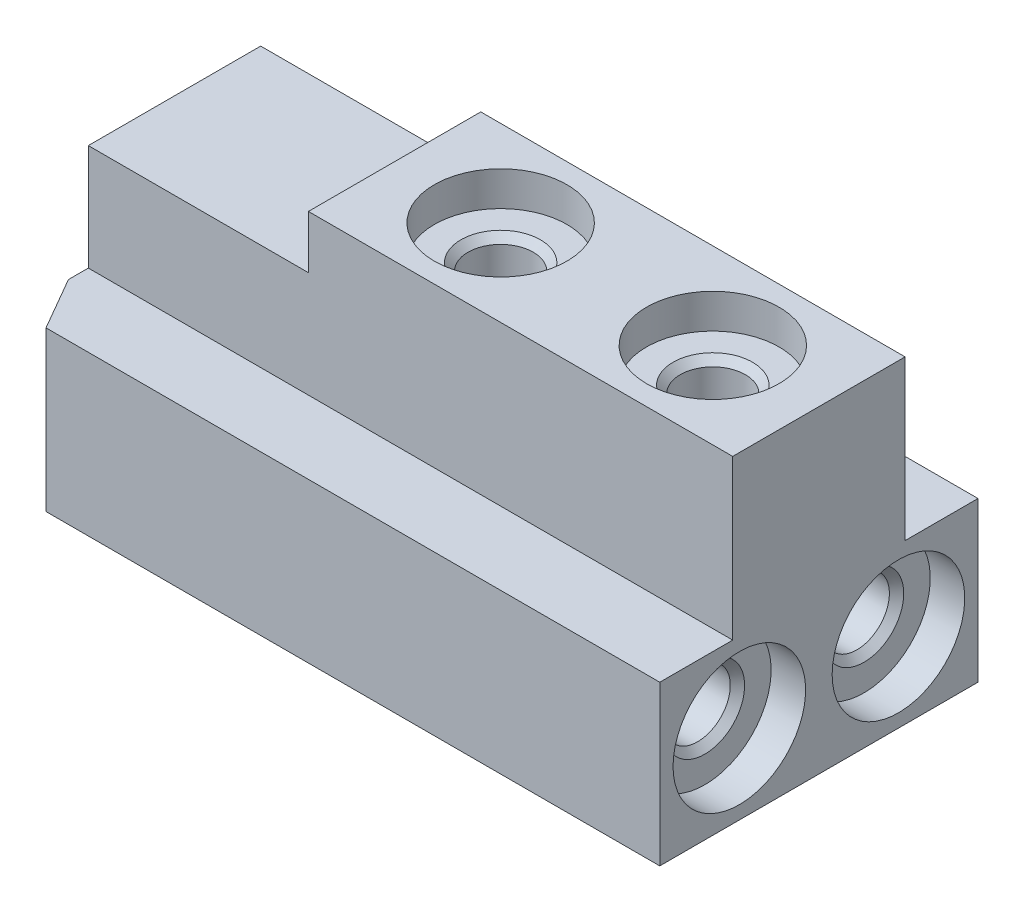
ISO-10303-21;
HEADER;
FILE_DESCRIPTION(('STEP AP214'),'2;1');
FILE_NAME('part.step','',(''),(''),'','','');
FILE_SCHEMA(('AUTOMOTIVE_DESIGN { 1 0 10303 214 1 1 1 1 }'));
ENDSEC;
DATA;
#1=APPLICATION_CONTEXT('core data for automotive mechanical design processes');
#2=APPLICATION_PROTOCOL_DEFINITION('international standard','automotive_design',2000,#1);
#3=PRODUCT_CONTEXT('',#1,'mechanical');
#4=PRODUCT('Part','Part','',(#3));
#5=PRODUCT_RELATED_PRODUCT_CATEGORY('part','',(#4));
#6=PRODUCT_DEFINITION_FORMATION('','',#4);
#7=PRODUCT_DEFINITION_CONTEXT('part definition',#1,'design');
#8=PRODUCT_DEFINITION('design','',#6,#7);
#9=PRODUCT_DEFINITION_SHAPE('','',#8);
#10=(LENGTH_UNIT() NAMED_UNIT(*) SI_UNIT(.MILLI.,.METRE.));
#11=(NAMED_UNIT(*) PLANE_ANGLE_UNIT() SI_UNIT($,.RADIAN.));
#12=(NAMED_UNIT(*) SI_UNIT($,.STERADIAN.) SOLID_ANGLE_UNIT());
#13=UNCERTAINTY_MEASURE_WITH_UNIT(LENGTH_MEASURE(1.E-05),#10,'distance_accuracy_value','');
#14=(GEOMETRIC_REPRESENTATION_CONTEXT(3) GLOBAL_UNCERTAINTY_ASSIGNED_CONTEXT((#13)) GLOBAL_UNIT_ASSIGNED_CONTEXT((#10,
#11,#12)) REPRESENTATION_CONTEXT('',''));
#15=CARTESIAN_POINT('',(0.,0.,0.));
#16=DIRECTION('',(0.,0.,1.));
#17=DIRECTION('',(1.,0.,0.));
#18=AXIS2_PLACEMENT_3D('',#15,#16,#17);
#19=CARTESIAN_POINT('',(24.3,6.,3.25));
#20=DIRECTION('',(0.,-1.,0.));
#21=DIRECTION('',(0.,0.,-1.));
#22=AXIS2_PLACEMENT_3D('',#19,#20,#21);
#23=PLANE('',#22);
#24=DIRECTION('',(-0.500000000000016,0.,-0.866025403784429));
#25=VECTOR('',#24,1.);
#26=CARTESIAN_POINT('',(1.1547005383793,6.,6.));
#27=LINE('',#26,#25);
#28=CARTESIAN_POINT('',(1.1547005383793,6.,6.));
#29=VERTEX_POINT('',#28);
#30=CARTESIAN_POINT('',(0.,6.,4.));
#31=VERTEX_POINT('',#30);
#32=EDGE_CURVE('E163',#29,#31,#27,.T.);
#33=ORIENTED_EDGE('',*,*,#32,.F.);
#34=DIRECTION('',(-1.,0.,0.));
#35=VECTOR('',#34,1.);
#36=CARTESIAN_POINT('',(24.3,6.,6.));
#37=LINE('',#36,#35);
#38=CARTESIAN_POINT('',(24.3,6.,6.));
#39=VERTEX_POINT('',#38);
#40=EDGE_CURVE('E149',#39,#29,#37,.T.);
#41=ORIENTED_EDGE('',*,*,#40,.F.);
#42=DIRECTION('',(0.,0.,1.));
#43=VECTOR('',#42,1.);
#44=CARTESIAN_POINT('',(24.3,6.,3.25));
#45=LINE('',#44,#43);
#46=CARTESIAN_POINT('',(24.3,6.,3.25));
#47=VERTEX_POINT('',#46);
#48=EDGE_CURVE('E290',#47,#39,#45,.T.);
#49=ORIENTED_EDGE('',*,*,#48,.F.);
#50=DIRECTION('',(-1.,0.,0.));
#51=VECTOR('',#50,1.);
#52=CARTESIAN_POINT('',(24.3,6.,3.25));
#53=LINE('',#52,#51);
#54=CARTESIAN_POINT('',(0.,6.,3.25));
#55=VERTEX_POINT('',#54);
#56=EDGE_CURVE('E314',#47,#55,#53,.T.);
#57=ORIENTED_EDGE('',*,*,#56,.T.);
#58=DIRECTION('',(0.,0.,1.));
#59=VECTOR('',#58,1.);
#60=CARTESIAN_POINT('',(0.,6.,3.25));
#61=LINE('',#60,#59);
#62=EDGE_CURVE('E171',#55,#31,#61,.T.);
#63=ORIENTED_EDGE('',*,*,#62,.T.);
#64=EDGE_LOOP('',(#33,#41,#49,#57,#63));
#65=FACE_BOUND('',#64,.T.);
#66=ADVANCED_FACE('F46',(#65),#23,.F.);
#67=CARTESIAN_POINT('',(24.3,6.,6.));
#68=DIRECTION('',(0.,0.,-1.));
#69=DIRECTION('',(-1.,0.,0.));
#70=AXIS2_PLACEMENT_3D('',#67,#68,#69);
#71=PLANE('',#70);
#72=DIRECTION('',(0.,-1.,0.));
#73=VECTOR('',#72,1.);
#74=CARTESIAN_POINT('',(1.1547005383793,6.,6.));
#75=LINE('',#74,#73);
#76=CARTESIAN_POINT('',(1.1547005383793,0.,6.));
#77=VERTEX_POINT('',#76);
#78=EDGE_CURVE('E153',#29,#77,#75,.T.);
#79=ORIENTED_EDGE('',*,*,#78,.T.);
#80=DIRECTION('',(-1.,0.,0.));
#81=VECTOR('',#80,1.);
#82=CARTESIAN_POINT('',(24.3,0.,6.));
#83=LINE('',#82,#81);
#84=CARTESIAN_POINT('',(24.3,0.,6.));
#85=VERTEX_POINT('',#84);
#86=EDGE_CURVE('E160',#85,#77,#83,.T.);
#87=ORIENTED_EDGE('',*,*,#86,.F.);
#88=DIRECTION('',(0.,-1.,0.));
#89=VECTOR('',#88,1.);
#90=CARTESIAN_POINT('',(24.3,6.,6.));
#91=LINE('',#90,#89);
#92=EDGE_CURVE('E154',#39,#85,#91,.T.);
#93=ORIENTED_EDGE('',*,*,#92,.F.);
#94=ORIENTED_EDGE('',*,*,#40,.T.);
#95=EDGE_LOOP('',(#79,#87,#93,#94));
#96=FACE_BOUND('',#95,.T.);
#97=ADVANCED_FACE('F151',(#96),#71,.F.);
#98=CARTESIAN_POINT('',(24.3,0.,6.));
#99=DIRECTION('',(0.,1.,0.));
#100=DIRECTION('',(0.,0.,1.));
#101=AXIS2_PLACEMENT_3D('',#98,#99,#100);
#102=PLANE('',#101);
#103=DIRECTION('',(-0.500000000000016,0.,-0.866025403784429));
#104=VECTOR('',#103,1.);
#105=CARTESIAN_POINT('',(1.1547005383793,0.,6.));
#106=LINE('',#105,#104);
#107=CARTESIAN_POINT('',(0.,0.,4.));
#108=VERTEX_POINT('',#107);
#109=EDGE_CURVE('E164',#77,#108,#106,.T.);
#110=ORIENTED_EDGE('',*,*,#109,.T.);
#111=DIRECTION('',(0.,0.,-1.));
#112=VECTOR('',#111,1.);
#113=CARTESIAN_POINT('',(0.,0.,6.));
#114=LINE('',#113,#112);
#115=CARTESIAN_POINT('',(0.,0.,-4.));
#116=VERTEX_POINT('',#115);
#117=EDGE_CURVE('E317',#108,#116,#114,.T.);
#118=ORIENTED_EDGE('',*,*,#117,.T.);
#119=DIRECTION('',(0.500000000000016,0.,-0.866025403784429));
#120=VECTOR('',#119,1.);
#121=CARTESIAN_POINT('',(0.,0.,-4.));
#122=LINE('',#121,#120);
#123=CARTESIAN_POINT('',(1.1547005383793,0.,-6.));
#124=VERTEX_POINT('',#123);
#125=EDGE_CURVE('E174',#116,#124,#122,.T.);
#126=ORIENTED_EDGE('',*,*,#125,.T.);
#127=DIRECTION('',(-1.,0.,0.));
#128=VECTOR('',#127,1.);
#129=CARTESIAN_POINT('',(24.3,0.,-6.));
#130=LINE('',#129,#128);
#131=CARTESIAN_POINT('',(24.3,0.,-6.));
#132=VERTEX_POINT('',#131);
#133=EDGE_CURVE('E347',#132,#124,#130,.T.);
#134=ORIENTED_EDGE('',*,*,#133,.F.);
#135=DIRECTION('',(0.,0.,-1.));
#136=VECTOR('',#135,1.);
#137=CARTESIAN_POINT('',(24.3,0.,6.));
#138=LINE('',#137,#136);
#139=EDGE_CURVE('E296',#85,#132,#138,.T.);
#140=ORIENTED_EDGE('',*,*,#139,.F.);
#141=ORIENTED_EDGE('',*,*,#86,.T.);
#142=EDGE_LOOP('',(#110,#118,#126,#134,#140,#141));
#143=FACE_BOUND('',#142,.T.);
#144=ADVANCED_FACE('F369',(#143),#102,.F.);
#145=CARTESIAN_POINT('',(24.3,0.,-6.));
#146=DIRECTION('',(0.,0.,1.));
#147=DIRECTION('',(1.,0.,0.));
#148=AXIS2_PLACEMENT_3D('',#145,#146,#147);
#149=PLANE('',#148);
#150=ORIENTED_EDGE('',*,*,#133,.T.);
#151=DIRECTION('',(0.,-1.,0.));
#152=VECTOR('',#151,1.);
#153=CARTESIAN_POINT('',(1.1547005383793,6.,-6.));
#154=LINE('',#153,#152);
#155=CARTESIAN_POINT('',(1.1547005383793,6.,-6.));
#156=VERTEX_POINT('',#155);
#157=EDGE_CURVE('E179',#156,#124,#154,.T.);
#158=ORIENTED_EDGE('',*,*,#157,.F.);
#159=DIRECTION('',(-1.,0.,0.));
#160=VECTOR('',#159,1.);
#161=CARTESIAN_POINT('',(24.3,6.,-6.));
#162=LINE('',#161,#160);
#163=CARTESIAN_POINT('',(24.3,6.,-6.));
#164=VERTEX_POINT('',#163);
#165=EDGE_CURVE('E344',#164,#156,#162,.T.);
#166=ORIENTED_EDGE('',*,*,#165,.F.);
#167=DIRECTION('',(0.,1.,0.));
#168=VECTOR('',#167,1.);
#169=CARTESIAN_POINT('',(24.3,0.,-6.));
#170=LINE('',#169,#168);
#171=EDGE_CURVE('E299',#132,#164,#170,.T.);
#172=ORIENTED_EDGE('',*,*,#171,.F.);
#173=EDGE_LOOP('',(#150,#158,#166,#172));
#174=FACE_BOUND('',#173,.T.);
#175=ADVANCED_FACE('F394',(#174),#149,.F.);
#176=CARTESIAN_POINT('',(24.3,6.,-6.));
#177=DIRECTION('',(0.,-1.,0.));
#178=DIRECTION('',(0.,0.,-1.));
#179=AXIS2_PLACEMENT_3D('',#176,#177,#178);
#180=PLANE('',#179);
#181=DIRECTION('',(0.500000000000016,0.,-0.866025403784429));
#182=VECTOR('',#181,1.);
#183=CARTESIAN_POINT('',(0.,6.,-4.));
#184=LINE('',#183,#182);
#185=CARTESIAN_POINT('',(0.,6.,-3.99999999999999));
#186=VERTEX_POINT('',#185);
#187=EDGE_CURVE('E173',#186,#156,#184,.T.);
#188=ORIENTED_EDGE('',*,*,#187,.F.);
#189=DIRECTION('',(0.,0.,1.));
#190=VECTOR('',#189,1.);
#191=CARTESIAN_POINT('',(0.,6.,-6.));
#192=LINE('',#191,#190);
#193=CARTESIAN_POINT('',(0.,6.,-3.25));
#194=VERTEX_POINT('',#193);
#195=EDGE_CURVE('E321',#186,#194,#192,.T.);
#196=ORIENTED_EDGE('',*,*,#195,.T.);
#197=DIRECTION('',(-1.,0.,0.));
#198=VECTOR('',#197,1.);
#199=CARTESIAN_POINT('',(24.3,6.,-3.25));
#200=LINE('',#199,#198);
#201=CARTESIAN_POINT('',(24.3,6.,-3.25));
#202=VERTEX_POINT('',#201);
#203=EDGE_CURVE('E340',#202,#194,#200,.T.);
#204=ORIENTED_EDGE('',*,*,#203,.F.);
#205=DIRECTION('',(0.,0.,1.));
#206=VECTOR('',#205,1.);
#207=CARTESIAN_POINT('',(24.3,6.,-6.));
#208=LINE('',#207,#206);
#209=EDGE_CURVE('E302',#164,#202,#208,.T.);
#210=ORIENTED_EDGE('',*,*,#209,.F.);
#211=ORIENTED_EDGE('',*,*,#165,.T.);
#212=EDGE_LOOP('',(#188,#196,#204,#210,#211));
#213=FACE_BOUND('',#212,.T.);
#214=ADVANCED_FACE('F389',(#213),#180,.F.);
#215=CARTESIAN_POINT('',(24.3,6.,-3.25));
#216=DIRECTION('',(0.,0.,1.));
#217=DIRECTION('',(1.,0.,0.));
#218=AXIS2_PLACEMENT_3D('',#215,#216,#217);
#219=PLANE('',#218);
#220=DIRECTION('',(-1.,0.,0.));
#221=VECTOR('',#220,1.);
#222=CARTESIAN_POINT('',(24.3,10.,-3.25));
#223=LINE('',#222,#221);
#224=CARTESIAN_POINT('',(8.3,10.,-3.25));
#225=VERTEX_POINT('',#224);
#226=CARTESIAN_POINT('',(0.,10.,-3.25));
#227=VERTEX_POINT('',#226);
#228=EDGE_CURVE('E283',#225,#227,#223,.T.);
#229=ORIENTED_EDGE('',*,*,#228,.F.);
#230=DIRECTION('',(0.,1.,0.));
#231=VECTOR('',#230,1.);
#232=CARTESIAN_POINT('',(8.3,6.,-3.25));
#233=LINE('',#232,#231);
#234=CARTESIAN_POINT('',(8.3,12.,-3.25));
#235=VERTEX_POINT('',#234);
#236=EDGE_CURVE('E286',#225,#235,#233,.T.);
#237=ORIENTED_EDGE('',*,*,#236,.T.);
#238=DIRECTION('',(-1.,0.,0.));
#239=VECTOR('',#238,1.);
#240=CARTESIAN_POINT('',(24.3,12.,-3.25));
#241=LINE('',#240,#239);
#242=CARTESIAN_POINT('',(24.3,12.,-3.25));
#243=VERTEX_POINT('',#242);
#244=EDGE_CURVE('E336',#243,#235,#241,.T.);
#245=ORIENTED_EDGE('',*,*,#244,.F.);
#246=DIRECTION('',(0.,1.,0.));
#247=VECTOR('',#246,1.);
#248=CARTESIAN_POINT('',(24.3,6.,-3.25));
#249=LINE('',#248,#247);
#250=EDGE_CURVE('E305',#202,#243,#249,.T.);
#251=ORIENTED_EDGE('',*,*,#250,.F.);
#252=ORIENTED_EDGE('',*,*,#203,.T.);
#253=DIRECTION('',(0.,1.,0.));
#254=VECTOR('',#253,1.);
#255=CARTESIAN_POINT('',(0.,6.,-3.25));
#256=LINE('',#255,#254);
#257=EDGE_CURVE('E324',#194,#227,#256,.T.);
#258=ORIENTED_EDGE('',*,*,#257,.T.);
#259=EDGE_LOOP('',(#229,#237,#245,#251,#252,#258));
#260=FACE_BOUND('',#259,.T.);
#261=ADVANCED_FACE('F385',(#260),#219,.F.);
#262=CARTESIAN_POINT('',(24.3,12.,3.25));
#263=DIRECTION('',(0.,0.,-1.));
#264=DIRECTION('',(-1.,0.,0.));
#265=AXIS2_PLACEMENT_3D('',#262,#263,#264);
#266=PLANE('',#265);
#267=DIRECTION('',(1.,0.,0.));
#268=VECTOR('',#267,1.);
#269=CARTESIAN_POINT('',(24.3,10.,3.25));
#270=LINE('',#269,#268);
#271=CARTESIAN_POINT('',(0.,10.,3.25));
#272=VERTEX_POINT('',#271);
#273=CARTESIAN_POINT('',(8.3,10.,3.25));
#274=VERTEX_POINT('',#273);
#275=EDGE_CURVE('E280',#272,#274,#270,.T.);
#276=ORIENTED_EDGE('',*,*,#275,.F.);
#277=DIRECTION('',(0.,-1.,0.));
#278=VECTOR('',#277,1.);
#279=CARTESIAN_POINT('',(0.,12.,3.25));
#280=LINE('',#279,#278);
#281=EDGE_CURVE('E293',#272,#55,#280,.T.);
#282=ORIENTED_EDGE('',*,*,#281,.T.);
#283=ORIENTED_EDGE('',*,*,#56,.F.);
#284=DIRECTION('',(0.,-1.,0.));
#285=VECTOR('',#284,1.);
#286=CARTESIAN_POINT('',(24.3,12.,3.25));
#287=LINE('',#286,#285);
#288=CARTESIAN_POINT('',(24.3,12.,3.25));
#289=VERTEX_POINT('',#288);
#290=EDGE_CURVE('E311',#289,#47,#287,.T.);
#291=ORIENTED_EDGE('',*,*,#290,.F.);
#292=DIRECTION('',(-1.,0.,0.));
#293=VECTOR('',#292,1.);
#294=CARTESIAN_POINT('',(24.3,12.,3.25));
#295=LINE('',#294,#293);
#296=CARTESIAN_POINT('',(8.3,12.,3.25));
#297=VERTEX_POINT('',#296);
#298=EDGE_CURVE('E332',#289,#297,#295,.T.);
#299=ORIENTED_EDGE('',*,*,#298,.T.);
#300=DIRECTION('',(0.,-1.,0.));
#301=VECTOR('',#300,1.);
#302=CARTESIAN_POINT('',(8.3,12.,3.25));
#303=LINE('',#302,#301);
#304=EDGE_CURVE('E11',#297,#274,#303,.T.);
#305=ORIENTED_EDGE('',*,*,#304,.T.);
#306=EDGE_LOOP('',(#276,#282,#283,#291,#299,#305));
#307=FACE_BOUND('',#306,.T.);
#308=ADVANCED_FACE('F363',(#307),#266,.F.);
#309=CARTESIAN_POINT('',(0.,0.,0.));
#310=DIRECTION('',(1.,0.,0.));
#311=DIRECTION('',(0.,0.,-1.));
#312=AXIS2_PLACEMENT_3D('',#309,#310,#311);
#313=PLANE('',#312);
#314=ORIENTED_EDGE('',*,*,#257,.F.);
#315=ORIENTED_EDGE('',*,*,#195,.F.);
#316=DIRECTION('',(0.,-1.,0.));
#317=VECTOR('',#316,1.);
#318=CARTESIAN_POINT('',(0.,6.,-4.));
#319=LINE('',#318,#317);
#320=EDGE_CURVE('E69',#186,#116,#319,.T.);
#321=ORIENTED_EDGE('',*,*,#320,.T.);
#322=ORIENTED_EDGE('',*,*,#117,.F.);
#323=DIRECTION('',(0.,-1.,0.));
#324=VECTOR('',#323,1.);
#325=CARTESIAN_POINT('',(0.,6.,4.));
#326=LINE('',#325,#324);
#327=EDGE_CURVE('E61',#31,#108,#326,.T.);
#328=ORIENTED_EDGE('',*,*,#327,.F.);
#329=ORIENTED_EDGE('',*,*,#62,.F.);
#330=ORIENTED_EDGE('',*,*,#281,.F.);
#331=DIRECTION('',(0.,0.,1.));
#332=VECTOR('',#331,1.);
#333=CARTESIAN_POINT('',(0.,10.,0.));
#334=LINE('',#333,#332);
#335=EDGE_CURVE('E54',#227,#272,#334,.T.);
#336=ORIENTED_EDGE('',*,*,#335,.F.);
#337=EDGE_LOOP('',(#314,#315,#321,#322,#328,#329,#330,#336));
#338=FACE_BOUND('',#337,.T.);
#339=ADVANCED_FACE('F365',(#338),#313,.F.);
#340=CARTESIAN_POINT('',(24.3,12.,-3.25));
#341=DIRECTION('',(0.,-1.,0.));
#342=DIRECTION('',(0.,0.,-1.));
#343=AXIS2_PLACEMENT_3D('',#340,#341,#342);
#344=PLANE('',#343);
#345=CARTESIAN_POINT('',(12.3,12.,0.));
#346=DIRECTION('',(0.,1.,0.));
#347=DIRECTION('',(0.,0.,1.));
#348=AXIS2_PLACEMENT_3D('',#345,#346,#347);
#349=CIRCLE('',#348,2.5);
#350=CARTESIAN_POINT('',(12.3,12.,2.5));
#351=VERTEX_POINT('',#350);
#352=EDGE_CURVE('E208',#351,#351,#349,.T.);
#353=ORIENTED_EDGE('',*,*,#352,.F.);
#354=EDGE_LOOP('',(#353));
#355=FACE_BOUND('',#354,.T.);
#356=CARTESIAN_POINT('',(20.3,12.,0.));
#357=DIRECTION('',(0.,1.,0.));
#358=DIRECTION('',(0.,0.,1.));
#359=AXIS2_PLACEMENT_3D('',#356,#357,#358);
#360=CIRCLE('',#359,2.5);
#361=CARTESIAN_POINT('',(20.3,12.,2.5));
#362=VERTEX_POINT('',#361);
#363=EDGE_CURVE('E228',#362,#362,#360,.T.);
#364=ORIENTED_EDGE('',*,*,#363,.F.);
#365=EDGE_LOOP('',(#364));
#366=FACE_BOUND('',#365,.T.);
#367=ORIENTED_EDGE('',*,*,#244,.T.);
#368=DIRECTION('',(0.,0.,1.));
#369=VECTOR('',#368,1.);
#370=CARTESIAN_POINT('',(8.3,12.,-6.));
#371=LINE('',#370,#369);
#372=EDGE_CURVE('E276',#235,#297,#371,.T.);
#373=ORIENTED_EDGE('',*,*,#372,.T.);
#374=ORIENTED_EDGE('',*,*,#298,.F.);
#375=DIRECTION('',(0.,0.,1.));
#376=VECTOR('',#375,1.);
#377=CARTESIAN_POINT('',(24.3,12.,-3.25));
#378=LINE('',#377,#376);
#379=EDGE_CURVE('E308',#243,#289,#378,.T.);
#380=ORIENTED_EDGE('',*,*,#379,.F.);
#381=EDGE_LOOP('',(#367,#373,#374,#380));
#382=FACE_BOUND('',#381,.T.);
#383=ADVANCED_FACE('F380',(#355,#366,#382),#344,.F.);
#384=CARTESIAN_POINT('',(24.3,0.,0.));
#385=DIRECTION('',(1.,0.,0.));
#386=DIRECTION('',(0.,0.,-1.));
#387=AXIS2_PLACEMENT_3D('',#384,#385,#386);
#388=PLANE('',#387);
#389=CARTESIAN_POINT('',(24.3,3.,3.));
#390=DIRECTION('',(-1.,0.,0.));
#391=DIRECTION('',(0.,0.,1.));
#392=AXIS2_PLACEMENT_3D('',#389,#390,#391);
#393=CIRCLE('',#392,2.5);
#394=CARTESIAN_POINT('',(24.3,3.,5.5));
#395=VERTEX_POINT('',#394);
#396=EDGE_CURVE('E232',#395,#395,#393,.T.);
#397=ORIENTED_EDGE('',*,*,#396,.T.);
#398=EDGE_LOOP('',(#397));
#399=FACE_BOUND('',#398,.T.);
#400=CARTESIAN_POINT('',(24.3,3.,-3.));
#401=DIRECTION('',(-1.,0.,0.));
#402=DIRECTION('',(0.,0.,1.));
#403=AXIS2_PLACEMENT_3D('',#400,#401,#402);
#404=CIRCLE('',#403,2.5);
#405=CARTESIAN_POINT('',(24.3,3.,-0.5));
#406=VERTEX_POINT('',#405);
#407=EDGE_CURVE('E252',#406,#406,#404,.T.);
#408=ORIENTED_EDGE('',*,*,#407,.T.);
#409=EDGE_LOOP('',(#408));
#410=FACE_BOUND('',#409,.T.);
#411=ORIENTED_EDGE('',*,*,#48,.T.);
#412=ORIENTED_EDGE('',*,*,#92,.T.);
#413=ORIENTED_EDGE('',*,*,#139,.T.);
#414=ORIENTED_EDGE('',*,*,#171,.T.);
#415=ORIENTED_EDGE('',*,*,#209,.T.);
#416=ORIENTED_EDGE('',*,*,#250,.T.);
#417=ORIENTED_EDGE('',*,*,#379,.T.);
#418=ORIENTED_EDGE('',*,*,#290,.T.);
#419=EDGE_LOOP('',(#411,#412,#413,#414,#415,#416,#417,#418));
#420=FACE_BOUND('',#419,.T.);
#421=ADVANCED_FACE('F374',(#399,#410,#420),#388,.T.);
#422=CARTESIAN_POINT('',(8.3,0.,0.));
#423=DIRECTION('',(1.,0.,0.));
#424=DIRECTION('',(0.,0.,-1.));
#425=AXIS2_PLACEMENT_3D('',#422,#423,#424);
#426=PLANE('',#425);
#427=DIRECTION('',(0.,0.,-1.));
#428=VECTOR('',#427,1.);
#429=CARTESIAN_POINT('',(8.3,10.,6.));
#430=LINE('',#429,#428);
#431=EDGE_CURVE('E272',#274,#225,#430,.T.);
#432=ORIENTED_EDGE('',*,*,#431,.F.);
#433=ORIENTED_EDGE('',*,*,#304,.F.);
#434=ORIENTED_EDGE('',*,*,#372,.F.);
#435=ORIENTED_EDGE('',*,*,#236,.F.);
#436=EDGE_LOOP('',(#432,#433,#434,#435));
#437=FACE_BOUND('',#436,.T.);
#438=ADVANCED_FACE('F383',(#437),#426,.F.);
#439=CARTESIAN_POINT('',(8.3,10.,6.));
#440=DIRECTION('',(0.,1.,0.));
#441=DIRECTION('',(0.,0.,1.));
#442=AXIS2_PLACEMENT_3D('',#439,#440,#441);
#443=PLANE('',#442);
#444=ORIENTED_EDGE('',*,*,#228,.T.);
#445=ORIENTED_EDGE('',*,*,#335,.T.);
#446=ORIENTED_EDGE('',*,*,#275,.T.);
#447=ORIENTED_EDGE('',*,*,#431,.T.);
#448=EDGE_LOOP('',(#444,#445,#446,#447));
#449=FACE_BOUND('',#448,.T.);
#450=ADVANCED_FACE('F356',(#449),#443,.T.);
#451=CARTESIAN_POINT('',(15.8499999999997,3.,-3.));
#452=DIRECTION('',(1.,0.,0.));
#453=DIRECTION('',(0.,0.,-1.));
#454=AXIS2_PLACEMENT_3D('',#451,#452,#453);
#455=CONICAL_SURFACE('',#454,1.22950000000015,1.0471975511966);
#456=CARTESIAN_POINT('',(15.140147844031,3.,-3.));
#457=VERTEX_POINT('',#456);
#458=VERTEX_LOOP('',#457);
#459=FACE_BOUND('',#458,.T.);
#460=CARTESIAN_POINT('',(15.8499999999997,3.,-3.));
#461=DIRECTION('',(-1.,0.,0.));
#462=DIRECTION('',(0.,0.,1.));
#463=AXIS2_PLACEMENT_3D('',#460,#461,#462);
#464=CIRCLE('',#463,1.22950000000015);
#465=CARTESIAN_POINT('',(15.8499999999997,3.,-1.77049999999985));
#466=VERTEX_POINT('',#465);
#467=EDGE_CURVE('E268',#466,#466,#464,.T.);
#468=ORIENTED_EDGE('',*,*,#467,.F.);
#469=EDGE_LOOP('',(#468));
#470=FACE_BOUND('',#469,.T.);
#471=ADVANCED_FACE('F485',(#459,#470),#455,.F.);
#472=CARTESIAN_POINT('',(24.3,3.,-3.));
#473=DIRECTION('',(-1.,0.,0.));
#474=DIRECTION('',(0.,0.,1.));
#475=AXIS2_PLACEMENT_3D('',#472,#473,#474);
#476=CYLINDRICAL_SURFACE('',#475,1.22950000000015);
#477=ORIENTED_EDGE('',*,*,#467,.T.);
#478=EDGE_LOOP('',(#477));
#479=FACE_BOUND('',#478,.T.);
#480=CARTESIAN_POINT('',(22.7294999999997,3.,-3.));
#481=DIRECTION('',(-1.,0.,0.));
#482=DIRECTION('',(0.,0.,1.));
#483=AXIS2_PLACEMENT_3D('',#480,#481,#482);
#484=CIRCLE('',#483,1.22950000000015);
#485=CARTESIAN_POINT('',(22.7294999999997,3.,-1.77049999999985));
#486=VERTEX_POINT('',#485);
#487=EDGE_CURVE('E264',#486,#486,#484,.T.);
#488=ORIENTED_EDGE('',*,*,#487,.F.);
#489=EDGE_LOOP('',(#488));
#490=FACE_BOUND('',#489,.T.);
#491=ADVANCED_FACE('F494',(#479,#490),#476,.F.);
#492=CARTESIAN_POINT('',(22.9999999999997,3.,-3.));
#493=DIRECTION('',(1.,0.,0.));
#494=DIRECTION('',(0.,0.,-1.));
#495=AXIS2_PLACEMENT_3D('',#492,#493,#494);
#496=CONICAL_SURFACE('',#495,1.50000000000015,0.785398163397451);
#497=ORIENTED_EDGE('',*,*,#487,.T.);
#498=EDGE_LOOP('',(#497));
#499=FACE_BOUND('',#498,.T.);
#500=CARTESIAN_POINT('',(22.9999999999997,3.,-3.));
#501=DIRECTION('',(-1.,0.,0.));
#502=DIRECTION('',(0.,0.,1.));
#503=AXIS2_PLACEMENT_3D('',#500,#501,#502);
#504=CIRCLE('',#503,1.50000000000015);
#505=CARTESIAN_POINT('',(22.9999999999997,3.,-1.49999999999985));
#506=VERTEX_POINT('',#505);
#507=EDGE_CURVE('E260',#506,#506,#504,.T.);
#508=ORIENTED_EDGE('',*,*,#507,.F.);
#509=EDGE_LOOP('',(#508));
#510=FACE_BOUND('',#509,.T.);
#511=ADVANCED_FACE('F506',(#499,#510),#496,.F.);
#512=CARTESIAN_POINT('',(22.9999999999997,3.,-4.50000000000015));
#513=DIRECTION('',(1.,0.,0.));
#514=DIRECTION('',(0.,0.,-1.));
#515=AXIS2_PLACEMENT_3D('',#512,#513,#514);
#516=PLANE('',#515);
#517=ORIENTED_EDGE('',*,*,#507,.T.);
#518=EDGE_LOOP('',(#517));
#519=FACE_BOUND('',#518,.T.);
#520=CARTESIAN_POINT('',(22.9999999999997,3.,-3.));
#521=DIRECTION('',(-1.,0.,0.));
#522=DIRECTION('',(0.,0.,1.));
#523=AXIS2_PLACEMENT_3D('',#520,#521,#522);
#524=CIRCLE('',#523,2.50000000000015);
#525=CARTESIAN_POINT('',(22.9999999999997,3.,-0.49999999999985));
#526=VERTEX_POINT('',#525);
#527=EDGE_CURVE('E256',#526,#526,#524,.T.);
#528=ORIENTED_EDGE('',*,*,#527,.F.);
#529=EDGE_LOOP('',(#528));
#530=FACE_BOUND('',#529,.T.);
#531=ADVANCED_FACE('F516',(#519,#530),#516,.T.);
#532=CARTESIAN_POINT('',(24.3,3.,-3.));
#533=DIRECTION('',(-1.,0.,0.));
#534=DIRECTION('',(0.,0.,1.));
#535=AXIS2_PLACEMENT_3D('',#532,#533,#534);
#536=CYLINDRICAL_SURFACE('',#535,2.50000000000008);
#537=ORIENTED_EDGE('',*,*,#527,.T.);
#538=EDGE_LOOP('',(#537));
#539=FACE_BOUND('',#538,.T.);
#540=ORIENTED_EDGE('',*,*,#407,.F.);
#541=EDGE_LOOP('',(#540));
#542=FACE_BOUND('',#541,.T.);
#543=ADVANCED_FACE('F526',(#539,#542),#536,.F.);
#544=CARTESIAN_POINT('',(15.8499999999997,3.,3.));
#545=DIRECTION('',(1.,0.,0.));
#546=DIRECTION('',(0.,0.,-1.));
#547=AXIS2_PLACEMENT_3D('',#544,#545,#546);
#548=CONICAL_SURFACE('',#547,1.22950000000015,1.0471975511966);
#549=CARTESIAN_POINT('',(15.140147844031,3.,3.));
#550=VERTEX_POINT('',#549);
#551=VERTEX_LOOP('',#550);
#552=FACE_BOUND('',#551,.T.);
#553=CARTESIAN_POINT('',(15.8499999999997,3.,3.));
#554=DIRECTION('',(-1.,0.,0.));
#555=DIRECTION('',(0.,0.,1.));
#556=AXIS2_PLACEMENT_3D('',#553,#554,#555);
#557=CIRCLE('',#556,1.22950000000015);
#558=CARTESIAN_POINT('',(15.8499999999997,3.,4.22950000000015));
#559=VERTEX_POINT('',#558);
#560=EDGE_CURVE('E248',#559,#559,#557,.T.);
#561=ORIENTED_EDGE('',*,*,#560,.F.);
#562=EDGE_LOOP('',(#561));
#563=FACE_BOUND('',#562,.T.);
#564=ADVANCED_FACE('F536',(#552,#563),#548,.F.);
#565=CARTESIAN_POINT('',(24.3,3.,3.));
#566=DIRECTION('',(-1.,0.,0.));
#567=DIRECTION('',(0.,0.,1.));
#568=AXIS2_PLACEMENT_3D('',#565,#566,#567);
#569=CYLINDRICAL_SURFACE('',#568,1.22950000000015);
#570=ORIENTED_EDGE('',*,*,#560,.T.);
#571=EDGE_LOOP('',(#570));
#572=FACE_BOUND('',#571,.T.);
#573=CARTESIAN_POINT('',(22.7294999999997,3.,3.));
#574=DIRECTION('',(-1.,0.,0.));
#575=DIRECTION('',(0.,0.,1.));
#576=AXIS2_PLACEMENT_3D('',#573,#574,#575);
#577=CIRCLE('',#576,1.22950000000015);
#578=CARTESIAN_POINT('',(22.7294999999997,3.,4.22950000000015));
#579=VERTEX_POINT('',#578);
#580=EDGE_CURVE('E244',#579,#579,#577,.T.);
#581=ORIENTED_EDGE('',*,*,#580,.F.);
#582=EDGE_LOOP('',(#581));
#583=FACE_BOUND('',#582,.T.);
#584=ADVANCED_FACE('F546',(#572,#583),#569,.F.);
#585=CARTESIAN_POINT('',(22.9999999999997,3.,3.));
#586=DIRECTION('',(1.,0.,0.));
#587=DIRECTION('',(0.,0.,-1.));
#588=AXIS2_PLACEMENT_3D('',#585,#586,#587);
#589=CONICAL_SURFACE('',#588,1.50000000000015,0.785398163397451);
#590=ORIENTED_EDGE('',*,*,#580,.T.);
#591=EDGE_LOOP('',(#590));
#592=FACE_BOUND('',#591,.T.);
#593=CARTESIAN_POINT('',(22.9999999999997,3.,3.));
#594=DIRECTION('',(-1.,0.,0.));
#595=DIRECTION('',(0.,0.,1.));
#596=AXIS2_PLACEMENT_3D('',#593,#594,#595);
#597=CIRCLE('',#596,1.50000000000015);
#598=CARTESIAN_POINT('',(22.9999999999997,3.,4.50000000000015));
#599=VERTEX_POINT('',#598);
#600=EDGE_CURVE('E240',#599,#599,#597,.T.);
#601=ORIENTED_EDGE('',*,*,#600,.F.);
#602=EDGE_LOOP('',(#601));
#603=FACE_BOUND('',#602,.T.);
#604=ADVANCED_FACE('F556',(#592,#603),#589,.F.);
#605=CARTESIAN_POINT('',(22.9999999999997,3.,1.49999999999985));
#606=DIRECTION('',(1.,0.,0.));
#607=DIRECTION('',(0.,0.,-1.));
#608=AXIS2_PLACEMENT_3D('',#605,#606,#607);
#609=PLANE('',#608);
#610=ORIENTED_EDGE('',*,*,#600,.T.);
#611=EDGE_LOOP('',(#610));
#612=FACE_BOUND('',#611,.T.);
#613=CARTESIAN_POINT('',(22.9999999999997,3.,3.));
#614=DIRECTION('',(-1.,0.,0.));
#615=DIRECTION('',(0.,0.,1.));
#616=AXIS2_PLACEMENT_3D('',#613,#614,#615);
#617=CIRCLE('',#616,2.50000000000015);
#618=CARTESIAN_POINT('',(22.9999999999997,3.,5.50000000000015));
#619=VERTEX_POINT('',#618);
#620=EDGE_CURVE('E236',#619,#619,#617,.T.);
#621=ORIENTED_EDGE('',*,*,#620,.F.);
#622=EDGE_LOOP('',(#621));
#623=FACE_BOUND('',#622,.T.);
#624=ADVANCED_FACE('F565',(#612,#623),#609,.T.);
#625=CARTESIAN_POINT('',(24.3,3.,3.));
#626=DIRECTION('',(-1.,0.,0.));
#627=DIRECTION('',(0.,0.,1.));
#628=AXIS2_PLACEMENT_3D('',#625,#626,#627);
#629=CYLINDRICAL_SURFACE('',#628,2.50000000000008);
#630=ORIENTED_EDGE('',*,*,#620,.T.);
#631=EDGE_LOOP('',(#630));
#632=FACE_BOUND('',#631,.T.);
#633=ORIENTED_EDGE('',*,*,#396,.F.);
#634=EDGE_LOOP('',(#633));
#635=FACE_BOUND('',#634,.T.);
#636=ADVANCED_FACE('F575',(#632,#635),#629,.F.);
#637=CARTESIAN_POINT('',(20.3,2.8401478440314,0.));
#638=DIRECTION('',(0.,1.,0.));
#639=DIRECTION('',(0.,0.,1.));
#640=AXIS2_PLACEMENT_3D('',#637,#638,#639);
#641=CYLINDRICAL_SURFACE('',#640,2.5);
#642=ORIENTED_EDGE('',*,*,#363,.T.);
#643=EDGE_LOOP('',(#642));
#644=FACE_BOUND('',#643,.T.);
#645=CARTESIAN_POINT('',(20.3,10.7,0.));
#646=DIRECTION('',(0.,1.,0.));
#647=DIRECTION('',(0.,0.,1.));
#648=AXIS2_PLACEMENT_3D('',#645,#646,#647);
#649=CIRCLE('',#648,2.5);
#650=CARTESIAN_POINT('',(20.3,10.7,2.5));
#651=VERTEX_POINT('',#650);
#652=EDGE_CURVE('E224',#651,#651,#649,.T.);
#653=ORIENTED_EDGE('',*,*,#652,.F.);
#654=EDGE_LOOP('',(#653));
#655=FACE_BOUND('',#654,.T.);
#656=ADVANCED_FACE('F585',(#644,#655),#641,.F.);
#657=CARTESIAN_POINT('',(22.8,10.7,0.));
#658=DIRECTION('',(0.,1.,0.));
#659=DIRECTION('',(0.,0.,1.));
#660=AXIS2_PLACEMENT_3D('',#657,#658,#659);
#661=PLANE('',#660);
#662=ORIENTED_EDGE('',*,*,#652,.T.);
#663=EDGE_LOOP('',(#662));
#664=FACE_BOUND('',#663,.T.);
#665=CARTESIAN_POINT('',(20.3,10.7,0.));
#666=DIRECTION('',(0.,1.,0.));
#667=DIRECTION('',(0.,0.,1.));
#668=AXIS2_PLACEMENT_3D('',#665,#666,#667);
#669=CIRCLE('',#668,1.5);
#670=CARTESIAN_POINT('',(20.3,10.7,1.5));
#671=VERTEX_POINT('',#670);
#672=EDGE_CURVE('E220',#671,#671,#669,.T.);
#673=ORIENTED_EDGE('',*,*,#672,.F.);
#674=EDGE_LOOP('',(#673));
#675=FACE_BOUND('',#674,.T.);
#676=ADVANCED_FACE('F595',(#664,#675),#661,.T.);
#677=CARTESIAN_POINT('',(20.3,10.4295,0.));
#678=DIRECTION('',(0.,1.,0.));
#679=DIRECTION('',(0.,0.,1.));
#680=AXIS2_PLACEMENT_3D('',#677,#678,#679);
#681=CONICAL_SURFACE('',#680,1.2295,0.785398163397451);
#682=ORIENTED_EDGE('',*,*,#672,.T.);
#683=EDGE_LOOP('',(#682));
#684=FACE_BOUND('',#683,.T.);
#685=CARTESIAN_POINT('',(20.3,10.4295,0.));
#686=DIRECTION('',(0.,1.,0.));
#687=DIRECTION('',(0.,0.,1.));
#688=AXIS2_PLACEMENT_3D('',#685,#686,#687);
#689=CIRCLE('',#688,1.2295);
#690=CARTESIAN_POINT('',(20.3,10.4295,1.2295));
#691=VERTEX_POINT('',#690);
#692=EDGE_CURVE('E216',#691,#691,#689,.T.);
#693=ORIENTED_EDGE('',*,*,#692,.F.);
#694=EDGE_LOOP('',(#693));
#695=FACE_BOUND('',#694,.T.);
#696=ADVANCED_FACE('F605',(#684,#695),#681,.F.);
#697=CARTESIAN_POINT('',(20.3,2.8401478440314,0.));
#698=DIRECTION('',(0.,1.,0.));
#699=DIRECTION('',(0.,0.,1.));
#700=AXIS2_PLACEMENT_3D('',#697,#698,#699);
#701=CYLINDRICAL_SURFACE('',#700,1.2295);
#702=ORIENTED_EDGE('',*,*,#692,.T.);
#703=EDGE_LOOP('',(#702));
#704=FACE_BOUND('',#703,.T.);
#705=CARTESIAN_POINT('',(20.3,3.55,0.));
#706=DIRECTION('',(0.,1.,0.));
#707=DIRECTION('',(0.,0.,1.));
#708=AXIS2_PLACEMENT_3D('',#705,#706,#707);
#709=CIRCLE('',#708,1.2295);
#710=CARTESIAN_POINT('',(20.3,3.55,1.2295));
#711=VERTEX_POINT('',#710);
#712=EDGE_CURVE('E212',#711,#711,#709,.T.);
#713=ORIENTED_EDGE('',*,*,#712,.F.);
#714=EDGE_LOOP('',(#713));
#715=FACE_BOUND('',#714,.T.);
#716=ADVANCED_FACE('F615',(#704,#715),#701,.F.);
#717=CARTESIAN_POINT('',(20.3,2.8401478440314,0.));
#718=DIRECTION('',(0.,1.,0.));
#719=DIRECTION('',(0.,0.,1.));
#720=AXIS2_PLACEMENT_3D('',#717,#718,#719);
#721=CONICAL_SURFACE('',#720,0.,1.04719755119662);
#722=ORIENTED_EDGE('',*,*,#712,.T.);
#723=EDGE_LOOP('',(#722));
#724=FACE_BOUND('',#723,.T.);
#725=CARTESIAN_POINT('',(20.3,2.8401478440314,0.));
#726=VERTEX_POINT('',#725);
#727=VERTEX_LOOP('',#726);
#728=FACE_BOUND('',#727,.T.);
#729=ADVANCED_FACE('F625',(#724,#728),#721,.F.);
#730=CARTESIAN_POINT('',(12.3,2.8401478440314,0.));
#731=DIRECTION('',(0.,1.,0.));
#732=DIRECTION('',(0.,0.,1.));
#733=AXIS2_PLACEMENT_3D('',#730,#731,#732);
#734=CYLINDRICAL_SURFACE('',#733,2.5);
#735=ORIENTED_EDGE('',*,*,#352,.T.);
#736=EDGE_LOOP('',(#735));
#737=FACE_BOUND('',#736,.T.);
#738=CARTESIAN_POINT('',(12.3,10.7,0.));
#739=DIRECTION('',(0.,1.,0.));
#740=DIRECTION('',(0.,0.,1.));
#741=AXIS2_PLACEMENT_3D('',#738,#739,#740);
#742=CIRCLE('',#741,2.5);
#743=CARTESIAN_POINT('',(12.3,10.7,2.5));
#744=VERTEX_POINT('',#743);
#745=EDGE_CURVE('E204',#744,#744,#742,.T.);
#746=ORIENTED_EDGE('',*,*,#745,.F.);
#747=EDGE_LOOP('',(#746));
#748=FACE_BOUND('',#747,.T.);
#749=ADVANCED_FACE('F634',(#737,#748),#734,.F.);
#750=CARTESIAN_POINT('',(14.8,10.7,0.));
#751=DIRECTION('',(0.,1.,0.));
#752=DIRECTION('',(0.,0.,1.));
#753=AXIS2_PLACEMENT_3D('',#750,#751,#752);
#754=PLANE('',#753);
#755=ORIENTED_EDGE('',*,*,#745,.T.);
#756=EDGE_LOOP('',(#755));
#757=FACE_BOUND('',#756,.T.);
#758=CARTESIAN_POINT('',(12.3,10.7,0.));
#759=DIRECTION('',(0.,1.,0.));
#760=DIRECTION('',(0.,0.,1.));
#761=AXIS2_PLACEMENT_3D('',#758,#759,#760);
#762=CIRCLE('',#761,1.5);
#763=CARTESIAN_POINT('',(12.3,10.7,1.5));
#764=VERTEX_POINT('',#763);
#765=EDGE_CURVE('E200',#764,#764,#762,.T.);
#766=ORIENTED_EDGE('',*,*,#765,.F.);
#767=EDGE_LOOP('',(#766));
#768=FACE_BOUND('',#767,.T.);
#769=ADVANCED_FACE('F645',(#757,#768),#754,.T.);
#770=CARTESIAN_POINT('',(12.3,10.4295,0.));
#771=DIRECTION('',(0.,1.,0.));
#772=DIRECTION('',(0.,0.,1.));
#773=AXIS2_PLACEMENT_3D('',#770,#771,#772);
#774=CONICAL_SURFACE('',#773,1.2295,0.785398163397451);
#775=ORIENTED_EDGE('',*,*,#765,.T.);
#776=EDGE_LOOP('',(#775));
#777=FACE_BOUND('',#776,.T.);
#778=CARTESIAN_POINT('',(12.3,10.4295,0.));
#779=DIRECTION('',(0.,1.,0.));
#780=DIRECTION('',(0.,0.,1.));
#781=AXIS2_PLACEMENT_3D('',#778,#779,#780);
#782=CIRCLE('',#781,1.2295);
#783=CARTESIAN_POINT('',(12.3,10.4295,1.2295));
#784=VERTEX_POINT('',#783);
#785=EDGE_CURVE('E196',#784,#784,#782,.T.);
#786=ORIENTED_EDGE('',*,*,#785,.F.);
#787=EDGE_LOOP('',(#786));
#788=FACE_BOUND('',#787,.T.);
#789=ADVANCED_FACE('F655',(#777,#788),#774,.F.);
#790=CARTESIAN_POINT('',(12.3,2.8401478440314,0.));
#791=DIRECTION('',(0.,1.,0.));
#792=DIRECTION('',(0.,0.,1.));
#793=AXIS2_PLACEMENT_3D('',#790,#791,#792);
#794=CYLINDRICAL_SURFACE('',#793,1.2295);
#795=ORIENTED_EDGE('',*,*,#785,.T.);
#796=EDGE_LOOP('',(#795));
#797=FACE_BOUND('',#796,.T.);
#798=CARTESIAN_POINT('',(12.3,3.55,0.));
#799=DIRECTION('',(0.,1.,0.));
#800=DIRECTION('',(0.,0.,1.));
#801=AXIS2_PLACEMENT_3D('',#798,#799,#800);
#802=CIRCLE('',#801,1.2295);
#803=CARTESIAN_POINT('',(12.3,3.55,1.2295));
#804=VERTEX_POINT('',#803);
#805=EDGE_CURVE('E166',#804,#804,#802,.T.);
#806=ORIENTED_EDGE('',*,*,#805,.F.);
#807=EDGE_LOOP('',(#806));
#808=FACE_BOUND('',#807,.T.);
#809=ADVANCED_FACE('F665',(#797,#808),#794,.F.);
#810=CARTESIAN_POINT('',(12.3,2.8401478440314,0.));
#811=DIRECTION('',(0.,1.,0.));
#812=DIRECTION('',(0.,0.,1.));
#813=AXIS2_PLACEMENT_3D('',#810,#811,#812);
#814=CONICAL_SURFACE('',#813,0.,1.04719755119663);
#815=ORIENTED_EDGE('',*,*,#805,.T.);
#816=EDGE_LOOP('',(#815));
#817=FACE_BOUND('',#816,.T.);
#818=CARTESIAN_POINT('',(12.3,2.8401478440314,0.));
#819=VERTEX_POINT('',#818);
#820=VERTEX_LOOP('',#819);
#821=FACE_BOUND('',#820,.T.);
#822=ADVANCED_FACE('F675',(#817,#821),#814,.F.);
#823=CARTESIAN_POINT('',(0.,6.,-4.));
#824=DIRECTION('',(-0.86602540378443,0.,-0.500000000000016));
#825=DIRECTION('',(-0.500000000000016,0.,0.86602540378443));
#826=AXIS2_PLACEMENT_3D('',#823,#824,#825);
#827=PLANE('',#826);
#828=ORIENTED_EDGE('',*,*,#125,.F.);
#829=ORIENTED_EDGE('',*,*,#320,.F.);
#830=ORIENTED_EDGE('',*,*,#187,.T.);
#831=ORIENTED_EDGE('',*,*,#157,.T.);
#832=EDGE_LOOP('',(#828,#829,#830,#831));
#833=FACE_BOUND('',#832,.T.);
#834=ADVANCED_FACE('F392',(#833),#827,.T.);
#835=CARTESIAN_POINT('',(1.1547005383793,6.,6.));
#836=DIRECTION('',(-0.86602540378443,0.,0.500000000000016));
#837=DIRECTION('',(0.500000000000016,0.,0.86602540378443));
#838=AXIS2_PLACEMENT_3D('',#835,#836,#837);
#839=PLANE('',#838);
#840=ORIENTED_EDGE('',*,*,#109,.F.);
#841=ORIENTED_EDGE('',*,*,#78,.F.);
#842=ORIENTED_EDGE('',*,*,#32,.T.);
#843=ORIENTED_EDGE('',*,*,#327,.T.);
#844=EDGE_LOOP('',(#840,#841,#842,#843));
#845=FACE_BOUND('',#844,.T.);
#846=ADVANCED_FACE('F162',(#845),#839,.T.);
#847=CLOSED_SHELL('',(#66,#97,#144,#175,#214,#261,#308,#339,#383,#421,#438,#450,#471,#491,#511,
#531,#543,#564,#584,#604,#624,#636,#656,#676,#696,#716,#729,#749,#769,#789,#809,#822,#834,#846));
#848=MANIFOLD_SOLID_BREP('B2',#847);
#849=ADVANCED_BREP_SHAPE_REPRESENTATION('',(#18,#848),#14);
#850=SHAPE_DEFINITION_REPRESENTATION(#9,#849);
ENDSEC;
END-ISO-10303-21;
